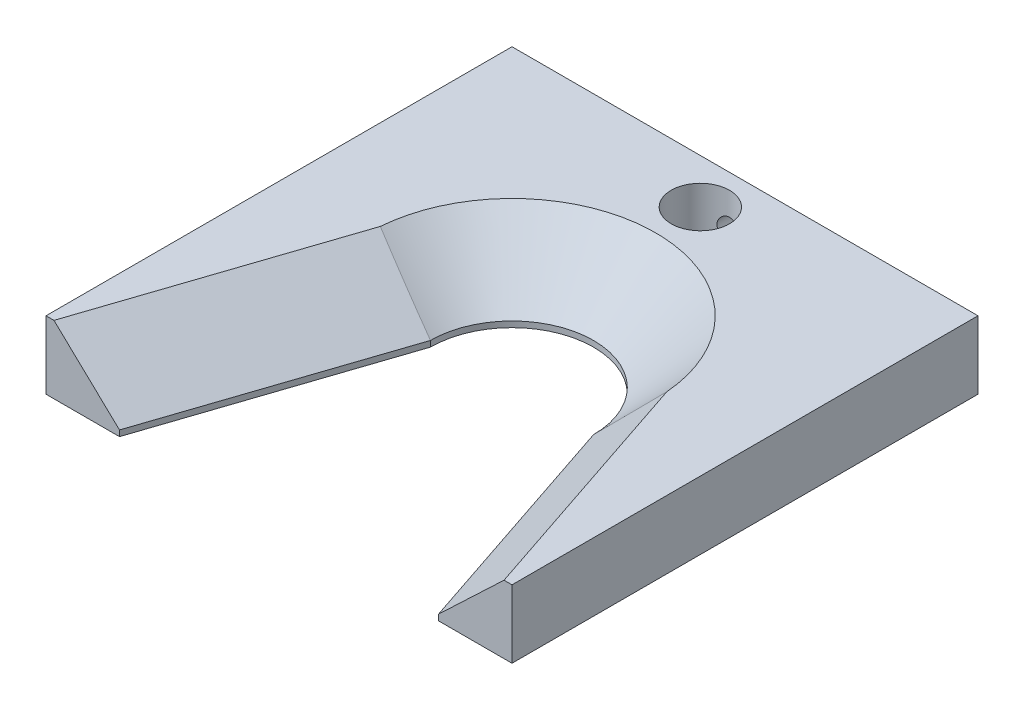
ISO-10303-21;
HEADER;
FILE_DESCRIPTION(('STEP AP214'),'2;1');
FILE_NAME('part.step','',(''),(''),'','','');
FILE_SCHEMA(('AUTOMOTIVE_DESIGN { 1 0 10303 214 1 1 1 1 }'));
ENDSEC;
DATA;
#1=APPLICATION_CONTEXT('core data for automotive mechanical design processes');
#2=APPLICATION_PROTOCOL_DEFINITION('international standard','automotive_design',2000,#1);
#3=PRODUCT_CONTEXT('',#1,'mechanical');
#4=PRODUCT('Part','Part','',(#3));
#5=PRODUCT_RELATED_PRODUCT_CATEGORY('part','',(#4));
#6=PRODUCT_DEFINITION_FORMATION('','',#4);
#7=PRODUCT_DEFINITION_CONTEXT('part definition',#1,'design');
#8=PRODUCT_DEFINITION('design','',#6,#7);
#9=PRODUCT_DEFINITION_SHAPE('','',#8);
#10=(LENGTH_UNIT() NAMED_UNIT(*) SI_UNIT(.MILLI.,.METRE.));
#11=(NAMED_UNIT(*) PLANE_ANGLE_UNIT() SI_UNIT($,.RADIAN.));
#12=(NAMED_UNIT(*) SI_UNIT($,.STERADIAN.) SOLID_ANGLE_UNIT());
#13=UNCERTAINTY_MEASURE_WITH_UNIT(LENGTH_MEASURE(1.E-05),#10,'distance_accuracy_value','');
#14=(GEOMETRIC_REPRESENTATION_CONTEXT(3) GLOBAL_UNCERTAINTY_ASSIGNED_CONTEXT((#13)) GLOBAL_UNIT_ASSIGNED_CONTEXT((#10,
#11,#12)) REPRESENTATION_CONTEXT('',''));
#15=CARTESIAN_POINT('',(0.,0.,0.));
#16=DIRECTION('',(0.,0.,1.));
#17=DIRECTION('',(1.,0.,0.));
#18=AXIS2_PLACEMENT_3D('',#15,#16,#17);
#19=CARTESIAN_POINT('',(0.,11.1125,0.));
#20=DIRECTION('',(0.,-1.,0.));
#21=DIRECTION('',(0.,0.,-1.));
#22=AXIS2_PLACEMENT_3D('',#19,#20,#21);
#23=CYLINDRICAL_SURFACE('',#22,13.335);
#24=DIRECTION('',(0.,-1.,0.));
#25=VECTOR('',#24,1.);
#26=CARTESIAN_POINT('',(13.335,11.1125,0.));
#27=LINE('',#26,#25);
#28=CARTESIAN_POINT('',(13.335,0.952500000000011,0.));
#29=VERTEX_POINT('',#28);
#30=CARTESIAN_POINT('',(13.335,0.,0.));
#31=VERTEX_POINT('',#30);
#32=EDGE_CURVE('E220',#29,#31,#27,.T.);
#33=ORIENTED_EDGE('',*,*,#32,.F.);
#34=CARTESIAN_POINT('',(0.,0.952500000000011,0.));
#35=DIRECTION('',(0.,1.,0.));
#36=DIRECTION('',(0.,0.,1.));
#37=AXIS2_PLACEMENT_3D('',#34,#35,#36);
#38=CIRCLE('',#37,13.335);
#39=CARTESIAN_POINT('',(-13.335,0.952500000000012,0.));
#40=VERTEX_POINT('',#39);
#41=EDGE_CURVE('E76',#29,#40,#38,.T.);
#42=ORIENTED_EDGE('',*,*,#41,.T.);
#43=DIRECTION('',(0.,-1.,0.));
#44=VECTOR('',#43,1.);
#45=CARTESIAN_POINT('',(-13.335,11.1125,0.));
#46=LINE('',#45,#44);
#47=CARTESIAN_POINT('',(-13.335,0.,0.));
#48=VERTEX_POINT('',#47);
#49=EDGE_CURVE('E198',#40,#48,#46,.T.);
#50=ORIENTED_EDGE('',*,*,#49,.T.);
#51=CARTESIAN_POINT('',(0.,0.,0.));
#52=DIRECTION('',(0.,1.,0.));
#53=DIRECTION('',(0.,0.,1.));
#54=AXIS2_PLACEMENT_3D('',#51,#52,#53);
#55=CIRCLE('',#54,13.335);
#56=EDGE_CURVE('E171',#31,#48,#55,.T.);
#57=ORIENTED_EDGE('',*,*,#56,.F.);
#58=EDGE_LOOP('',(#33,#42,#50,#57));
#59=FACE_BOUND('',#58,.T.);
#60=ADVANCED_FACE('F44',(#59),#23,.F.);
#61=CARTESIAN_POINT('',(11.9924022632403,11.1125,-4.01260166686629));
#62=DIRECTION('',(0.948323655206199,0.,-0.317304656405093));
#63=DIRECTION('',(-0.317304656405093,0.,-0.948323655206199));
#64=AXIS2_PLACEMENT_3D('',#61,#62,#63);
#65=PLANE('',#64);
#66=DIRECTION('',(0.,-1.,0.));
#67=VECTOR('',#66,1.);
#68=CARTESIAN_POINT('',(26.083081673029,11.1125,38.1));
#69=LINE('',#68,#67);
#70=CARTESIAN_POINT('',(26.083081673029,0.952500000000009,38.1));
#71=VERTEX_POINT('',#70);
#72=CARTESIAN_POINT('',(26.083081673029,0.,38.1));
#73=VERTEX_POINT('',#72);
#74=EDGE_CURVE('E217',#71,#73,#69,.T.);
#75=ORIENTED_EDGE('',*,*,#74,.F.);
#76=DIRECTION('',(-0.317304656405093,0.,-0.948323655206199));
#77=VECTOR('',#76,1.);
#78=CARTESIAN_POINT('',(13.335,0.952500000000008,0.));
#79=LINE('',#78,#77);
#80=EDGE_CURVE('E236',#71,#29,#79,.T.);
#81=ORIENTED_EDGE('',*,*,#80,.T.);
#82=ORIENTED_EDGE('',*,*,#32,.T.);
#83=DIRECTION('',(0.317304656405093,0.,0.948323655206199));
#84=VECTOR('',#83,1.);
#85=CARTESIAN_POINT('',(11.9924022632403,0.,-4.01260166686629));
#86=LINE('',#85,#84);
#87=EDGE_CURVE('E175',#31,#73,#86,.T.);
#88=ORIENTED_EDGE('',*,*,#87,.T.);
#89=EDGE_LOOP('',(#75,#81,#82,#88));
#90=FACE_BOUND('',#89,.T.);
#91=ADVANCED_FACE('F271',(#90),#65,.F.);
#92=CARTESIAN_POINT('',(0.,11.1125,38.1));
#93=DIRECTION('',(0.,0.,1.));
#94=DIRECTION('',(1.,0.,0.));
#95=AXIS2_PLACEMENT_3D('',#92,#93,#94);
#96=PLANE('',#95);
#97=DIRECTION('',(-1.,0.,0.));
#98=VECTOR('',#97,1.);
#99=CARTESIAN_POINT('',(0.,11.1125,38.1));
#100=LINE('',#99,#98);
#101=CARTESIAN_POINT('',(38.1,11.1125,38.1));
#102=VERTEX_POINT('',#101);
#103=CARTESIAN_POINT('',(36.7967235232799,11.1125,38.1));
#104=VERTEX_POINT('',#103);
#105=EDGE_CURVE('E154',#102,#104,#100,.T.);
#106=ORIENTED_EDGE('',*,*,#105,.T.);
#107=DIRECTION('',(-0.725606535862985,-0.688109842331091,0.));
#108=VECTOR('',#107,1.);
#109=CARTESIAN_POINT('',(17.4230703123026,-7.25999362773124,38.1));
#110=LINE('',#109,#108);
#111=EDGE_CURVE('E233',#104,#71,#110,.T.);
#112=ORIENTED_EDGE('',*,*,#111,.T.);
#113=ORIENTED_EDGE('',*,*,#74,.T.);
#114=DIRECTION('',(-1.,0.,0.));
#115=VECTOR('',#114,1.);
#116=CARTESIAN_POINT('',(0.,0.,38.1));
#117=LINE('',#116,#115);
#118=CARTESIAN_POINT('',(38.1,0.,38.1));
#119=VERTEX_POINT('',#118);
#120=EDGE_CURVE('E179',#119,#73,#117,.T.);
#121=ORIENTED_EDGE('',*,*,#120,.F.);
#122=DIRECTION('',(0.,-1.,0.));
#123=VECTOR('',#122,1.);
#124=CARTESIAN_POINT('',(38.1,11.1125,38.1));
#125=LINE('',#124,#123);
#126=EDGE_CURVE('E214',#102,#119,#125,.T.);
#127=ORIENTED_EDGE('',*,*,#126,.F.);
#128=EDGE_LOOP('',(#106,#112,#113,#121,#127));
#129=FACE_BOUND('',#128,.T.);
#130=ADVANCED_FACE('F275',(#129),#96,.T.);
#131=CARTESIAN_POINT('',(38.1,11.1125,0.));
#132=DIRECTION('',(1.,0.,0.));
#133=DIRECTION('',(0.,0.,-1.));
#134=AXIS2_PLACEMENT_3D('',#131,#132,#133);
#135=PLANE('',#134);
#136=DIRECTION('',(0.,0.,1.));
#137=VECTOR('',#136,1.);
#138=CARTESIAN_POINT('',(38.1,0.,0.));
#139=LINE('',#138,#137);
#140=CARTESIAN_POINT('',(38.1,0.,-38.1));
#141=VERTEX_POINT('',#140);
#142=EDGE_CURVE('E183',#141,#119,#139,.T.);
#143=ORIENTED_EDGE('',*,*,#142,.F.);
#144=DIRECTION('',(0.,-1.,0.));
#145=VECTOR('',#144,1.);
#146=CARTESIAN_POINT('',(38.1,11.1125,-38.1));
#147=LINE('',#146,#145);
#148=CARTESIAN_POINT('',(38.1,11.1125,-38.1));
#149=VERTEX_POINT('',#148);
#150=EDGE_CURVE('E211',#149,#141,#147,.T.);
#151=ORIENTED_EDGE('',*,*,#150,.F.);
#152=DIRECTION('',(0.,0.,1.));
#153=VECTOR('',#152,1.);
#154=CARTESIAN_POINT('',(38.1,11.1125,0.));
#155=LINE('',#154,#153);
#156=EDGE_CURVE('E158',#149,#102,#155,.T.);
#157=ORIENTED_EDGE('',*,*,#156,.T.);
#158=ORIENTED_EDGE('',*,*,#126,.T.);
#159=EDGE_LOOP('',(#143,#151,#157,#158));
#160=FACE_BOUND('',#159,.T.);
#161=ADVANCED_FACE('F279',(#160),#135,.T.);
#162=CARTESIAN_POINT('',(0.,11.1125,-38.1));
#163=DIRECTION('',(0.,0.,1.));
#164=DIRECTION('',(1.,0.,0.));
#165=AXIS2_PLACEMENT_3D('',#162,#163,#164);
#166=PLANE('',#165);
#167=CARTESIAN_POINT('',(0.,5.55625,-38.1));
#168=DIRECTION('',(0.,0.,-1.));
#169=DIRECTION('',(-1.,0.,0.));
#170=AXIS2_PLACEMENT_3D('',#167,#168,#169);
#171=CIRCLE('',#170,1.7272);
#172=CARTESIAN_POINT('',(-1.72719999999999,5.55625,-38.1));
#173=VERTEX_POINT('',#172);
#174=EDGE_CURVE('E143',#173,#173,#171,.T.);
#175=ORIENTED_EDGE('',*,*,#174,.F.);
#176=EDGE_LOOP('',(#175));
#177=FACE_BOUND('',#176,.T.);
#178=DIRECTION('',(-1.,0.,0.));
#179=VECTOR('',#178,1.);
#180=CARTESIAN_POINT('',(0.,0.,-38.1));
#181=LINE('',#180,#179);
#182=CARTESIAN_POINT('',(-38.1,0.,-38.1));
#183=VERTEX_POINT('',#182);
#184=EDGE_CURVE('E188',#141,#183,#181,.T.);
#185=ORIENTED_EDGE('',*,*,#184,.T.);
#186=DIRECTION('',(0.,-1.,0.));
#187=VECTOR('',#186,1.);
#188=CARTESIAN_POINT('',(-38.1,11.1125,-38.1));
#189=LINE('',#188,#187);
#190=CARTESIAN_POINT('',(-38.1,11.1125,-38.1));
#191=VERTEX_POINT('',#190);
#192=EDGE_CURVE('E207',#191,#183,#189,.T.);
#193=ORIENTED_EDGE('',*,*,#192,.F.);
#194=DIRECTION('',(-1.,0.,0.));
#195=VECTOR('',#194,1.);
#196=CARTESIAN_POINT('',(0.,11.1125,-38.1));
#197=LINE('',#196,#195);
#198=EDGE_CURVE('E164',#149,#191,#197,.T.);
#199=ORIENTED_EDGE('',*,*,#198,.F.);
#200=ORIENTED_EDGE('',*,*,#150,.T.);
#201=EDGE_LOOP('',(#185,#193,#199,#200));
#202=FACE_BOUND('',#201,.T.);
#203=ADVANCED_FACE('F282',(#177,#202),#166,.F.);
#204=CARTESIAN_POINT('',(-38.1,11.1125,0.));
#205=DIRECTION('',(1.,0.,0.));
#206=DIRECTION('',(0.,0.,-1.));
#207=AXIS2_PLACEMENT_3D('',#204,#205,#206);
#208=PLANE('',#207);
#209=DIRECTION('',(0.,0.,1.));
#210=VECTOR('',#209,1.);
#211=CARTESIAN_POINT('',(-38.1,0.,0.));
#212=LINE('',#211,#210);
#213=CARTESIAN_POINT('',(-38.1,0.,38.1));
#214=VERTEX_POINT('',#213);
#215=EDGE_CURVE('E191',#183,#214,#212,.T.);
#216=ORIENTED_EDGE('',*,*,#215,.T.);
#217=DIRECTION('',(0.,-1.,0.));
#218=VECTOR('',#217,1.);
#219=CARTESIAN_POINT('',(-38.1,11.1125,38.1));
#220=LINE('',#219,#218);
#221=CARTESIAN_POINT('',(-38.1,11.1125,38.1));
#222=VERTEX_POINT('',#221);
#223=EDGE_CURVE('E204',#222,#214,#220,.T.);
#224=ORIENTED_EDGE('',*,*,#223,.F.);
#225=DIRECTION('',(0.,0.,1.));
#226=VECTOR('',#225,1.);
#227=CARTESIAN_POINT('',(-38.1,11.1125,0.));
#228=LINE('',#227,#226);
#229=EDGE_CURVE('E167',#191,#222,#228,.T.);
#230=ORIENTED_EDGE('',*,*,#229,.F.);
#231=ORIENTED_EDGE('',*,*,#192,.T.);
#232=EDGE_LOOP('',(#216,#224,#230,#231));
#233=FACE_BOUND('',#232,.T.);
#234=ADVANCED_FACE('F286',(#233),#208,.F.);
#235=DIRECTION('',(0.,-1.,0.));
#236=VECTOR('',#235,1.);
#237=CARTESIAN_POINT('',(-26.083081673029,11.1125,38.1));
#238=LINE('',#237,#236);
#239=CARTESIAN_POINT('',(-26.083081673029,0.952500000000012,38.1));
#240=VERTEX_POINT('',#239);
#241=CARTESIAN_POINT('',(-26.083081673029,0.,38.1));
#242=VERTEX_POINT('',#241);
#243=EDGE_CURVE('E201',#240,#242,#238,.T.);
#244=ORIENTED_EDGE('',*,*,#243,.F.);
#245=DIRECTION('',(0.725606535862985,-0.688109842331091,0.));
#246=VECTOR('',#245,1.);
#247=CARTESIAN_POINT('',(-17.4230703123026,-7.25999362773123,38.1));
#248=LINE('',#247,#246);
#249=CARTESIAN_POINT('',(-36.7967235232799,11.1125,38.1));
#250=VERTEX_POINT('',#249);
#251=EDGE_CURVE('E11',#240,#250,#248,.F.);
#252=ORIENTED_EDGE('',*,*,#251,.T.);
#253=EDGE_CURVE('E160',#250,#222,#100,.T.);
#254=ORIENTED_EDGE('',*,*,#253,.T.);
#255=ORIENTED_EDGE('',*,*,#223,.T.);
#256=EDGE_CURVE('E184',#242,#214,#117,.T.);
#257=ORIENTED_EDGE('',*,*,#256,.F.);
#258=EDGE_LOOP('',(#244,#252,#254,#255,#257));
#259=FACE_BOUND('',#258,.T.);
#260=ADVANCED_FACE('F290',(#259),#96,.T.);
#261=CARTESIAN_POINT('',(-11.9924022632403,11.1125,-4.01260166686629));
#262=DIRECTION('',(0.948323655206199,0.,0.317304656405093));
#263=DIRECTION('',(0.317304656405093,0.,-0.948323655206199));
#264=AXIS2_PLACEMENT_3D('',#261,#262,#263);
#265=PLANE('',#264);
#266=ORIENTED_EDGE('',*,*,#49,.F.);
#267=DIRECTION('',(-0.317304656405093,0.,0.948323655206199));
#268=VECTOR('',#267,1.);
#269=CARTESIAN_POINT('',(-11.9924022632403,0.952500000000012,-4.01260166686629));
#270=LINE('',#269,#268);
#271=EDGE_CURVE('E61',#40,#240,#270,.T.);
#272=ORIENTED_EDGE('',*,*,#271,.T.);
#273=ORIENTED_EDGE('',*,*,#243,.T.);
#274=DIRECTION('',(-0.317304656405093,0.,0.948323655206199));
#275=VECTOR('',#274,1.);
#276=CARTESIAN_POINT('',(-11.9924022632403,0.,-4.01260166686629));
#277=LINE('',#276,#275);
#278=EDGE_CURVE('E159',#48,#242,#277,.T.);
#279=ORIENTED_EDGE('',*,*,#278,.F.);
#280=EDGE_LOOP('',(#266,#272,#273,#279));
#281=FACE_BOUND('',#280,.T.);
#282=ADVANCED_FACE('F294',(#281),#265,.T.);
#283=CARTESIAN_POINT('',(0.,11.1125,0.));
#284=DIRECTION('',(0.,1.,0.));
#285=DIRECTION('',(0.,0.,1.));
#286=AXIS2_PLACEMENT_3D('',#283,#284,#285);
#287=PLANE('',#286);
#288=CARTESIAN_POINT('',(0.,11.1125,-30.7975));
#289=DIRECTION('',(0.,1.,0.));
#290=DIRECTION('',(0.,0.,1.));
#291=AXIS2_PLACEMENT_3D('',#288,#289,#290);
#292=CIRCLE('',#291,4.7625);
#293=CARTESIAN_POINT('',(0.,11.1125,-26.035));
#294=VERTEX_POINT('',#293);
#295=EDGE_CURVE('E320',#294,#294,#292,.T.);
#296=ORIENTED_EDGE('',*,*,#295,.F.);
#297=EDGE_LOOP('',(#296));
#298=FACE_BOUND('',#297,.T.);
#299=CARTESIAN_POINT('',(0.,11.1125,0.));
#300=DIRECTION('',(0.,1.,0.));
#301=DIRECTION('',(0.,0.,1.));
#302=AXIS2_PLACEMENT_3D('',#299,#300,#301);
#303=CIRCLE('',#302,23.495);
#304=CARTESIAN_POINT('',(-23.4196823274798,11.1125,-1.87976186787994));
#305=VERTEX_POINT('',#304);
#306=CARTESIAN_POINT('',(23.4196823274797,11.1125,-1.87976186788));
#307=VERTEX_POINT('',#306);
#308=EDGE_CURVE('E226',#305,#307,#303,.F.);
#309=ORIENTED_EDGE('',*,*,#308,.T.);
#310=DIRECTION('',(0.317304656405093,0.,0.948323655206199));
#311=VECTOR('',#310,1.);
#312=CARTESIAN_POINT('',(35.718050009924,11.1125,34.8761846909243));
#313=LINE('',#312,#311);
#314=EDGE_CURVE('E229',#307,#104,#313,.T.);
#315=ORIENTED_EDGE('',*,*,#314,.T.);
#316=ORIENTED_EDGE('',*,*,#105,.F.);
#317=ORIENTED_EDGE('',*,*,#156,.F.);
#318=ORIENTED_EDGE('',*,*,#198,.T.);
#319=ORIENTED_EDGE('',*,*,#229,.T.);
#320=ORIENTED_EDGE('',*,*,#253,.F.);
#321=DIRECTION('',(0.317304656405093,0.,-0.948323655206199));
#322=VECTOR('',#321,1.);
#323=CARTESIAN_POINT('',(-21.6273706001353,11.1125,-7.23641697594204));
#324=LINE('',#323,#322);
#325=EDGE_CURVE('E223',#250,#305,#324,.T.);
#326=ORIENTED_EDGE('',*,*,#325,.T.);
#327=EDGE_LOOP('',(#309,#315,#316,#317,#318,#319,#320,#326));
#328=FACE_BOUND('',#327,.T.);
#329=ADVANCED_FACE('F298',(#298,#328),#287,.T.);
#330=CARTESIAN_POINT('',(0.,0.,0.));
#331=DIRECTION('',(0.,1.,0.));
#332=DIRECTION('',(0.,0.,1.));
#333=AXIS2_PLACEMENT_3D('',#330,#331,#332);
#334=PLANE('',#333);
#335=CARTESIAN_POINT('',(0.,0.,-30.7975));
#336=DIRECTION('',(0.,1.,0.));
#337=DIRECTION('',(0.,0.,1.));
#338=AXIS2_PLACEMENT_3D('',#335,#336,#337);
#339=CIRCLE('',#338,4.7625);
#340=CARTESIAN_POINT('',(0.,0.,-26.035));
#341=VERTEX_POINT('',#340);
#342=EDGE_CURVE('E314',#341,#341,#339,.T.);
#343=ORIENTED_EDGE('',*,*,#342,.T.);
#344=EDGE_LOOP('',(#343));
#345=FACE_BOUND('',#344,.T.);
#346=ORIENTED_EDGE('',*,*,#56,.T.);
#347=ORIENTED_EDGE('',*,*,#278,.T.);
#348=ORIENTED_EDGE('',*,*,#256,.T.);
#349=ORIENTED_EDGE('',*,*,#215,.F.);
#350=ORIENTED_EDGE('',*,*,#184,.F.);
#351=ORIENTED_EDGE('',*,*,#142,.T.);
#352=ORIENTED_EDGE('',*,*,#120,.T.);
#353=ORIENTED_EDGE('',*,*,#87,.F.);
#354=EDGE_LOOP('',(#346,#347,#348,#349,#350,#351,#352,#353));
#355=FACE_BOUND('',#354,.T.);
#356=ADVANCED_FACE('F299',(#345,#355),#334,.F.);
#357=CARTESIAN_POINT('',(-11.9924022632403,0.952500000000011,-4.01260166686629));
#358=DIRECTION('',(-0.670566087355916,-0.707106781186549,-0.224368274246108));
#359=DIRECTION('',(-0.317304656405093,0.,0.948323655206199));
#360=AXIS2_PLACEMENT_3D('',#357,#358,#359);
#361=PLANE('',#360);
#362=ORIENTED_EDGE('',*,*,#251,.F.);
#363=ORIENTED_EDGE('',*,*,#271,.F.);
#364=CARTESIAN_POINT('',(-13.335,0.952500000000012,0.));
#365=CARTESIAN_POINT('',(-14.1802182107889,1.79777629778931,-0.137835590509843));
#366=CARTESIAN_POINT('',(-15.0239193030969,2.64354546694068,-0.28175867663717));
#367=CARTESIAN_POINT('',(-16.708748163143,4.33580986815329,-0.579583925492418));
#368=CARTESIAN_POINT('',(-17.5498760556182,5.1823050623891,-0.733485596212048));
#369=CARTESIAN_POINT('',(-19.2300756855446,6.87581802542853,-1.04908105467809));
#370=CARTESIAN_POINT('',(-20.0691474880417,7.72283577661118,-1.21077459248934));
#371=CARTESIAN_POINT('',(-21.7456096435228,9.41734861276061,-1.54069133003352));
#372=CARTESIAN_POINT('',(-22.5829999124839,10.2648437189974,-1.70891484791784));
#373=CARTESIAN_POINT('',(-23.4196823274798,11.1125,-1.87976186787987));
#374=B_SPLINE_CURVE_WITH_KNOTS('',3,(#364,#365,#366,#367,#368,#369,#370,#371,#372,#373),
.UNSPECIFIED.,.F.,.F.,(4,2,2,2,4),(0.,3.60979400428527,7.21941015770133,10.8289106045433,
14.4385871334727),.UNSPECIFIED.);
#375=EDGE_CURVE('E148',#305,#40,#374,.F.);
#376=ORIENTED_EDGE('',*,*,#375,.F.);
#377=ORIENTED_EDGE('',*,*,#325,.F.);
#378=EDGE_LOOP('',(#362,#363,#376,#377));
#379=FACE_BOUND('',#378,.T.);
#380=ADVANCED_FACE('F47',(#379),#361,.F.);
#381=CARTESIAN_POINT('',(0.,0.952500000000011,0.));
#382=DIRECTION('',(0.,1.,0.));
#383=DIRECTION('',(0.,0.,1.));
#384=AXIS2_PLACEMENT_3D('',#381,#382,#383);
#385=CONICAL_SURFACE('',#384,13.335,0.78539816339745);
#386=ORIENTED_EDGE('',*,*,#375,.T.);
#387=ORIENTED_EDGE('',*,*,#41,.F.);
#388=CARTESIAN_POINT('',(13.335,0.952500000000011,0.));
#389=CARTESIAN_POINT('',(14.1802182107889,1.79777629778931,-0.137835590509873));
#390=CARTESIAN_POINT('',(15.0239193030969,2.64354546694069,-0.281758676637214));
#391=CARTESIAN_POINT('',(16.708748163143,4.3358098681533,-0.579583925492474));
#392=CARTESIAN_POINT('',(17.5498760556182,5.18230506238911,-0.733485596212103));
#393=CARTESIAN_POINT('',(19.2300756855446,6.87581802542855,-1.04908105467815));
#394=CARTESIAN_POINT('',(20.0691474880417,7.72283577661119,-1.2107745924894));
#395=CARTESIAN_POINT('',(21.7456096435228,9.41734861276063,-1.5406913300336));
#396=CARTESIAN_POINT('',(22.5829999124839,10.2648437189975,-1.70891484791793));
#397=CARTESIAN_POINT('',(23.4196823274798,11.1125,-1.87976186787997));
#398=B_SPLINE_CURVE_WITH_KNOTS('',3,(#388,#389,#390,#391,#392,#393,#394,#395,#396,#397),
.UNSPECIFIED.,.F.,.F.,(4,2,2,2,4),(0.,3.60979400428527,7.21941015770135,10.8289106045433,
14.4385871334728),.UNSPECIFIED.);
#399=EDGE_CURVE('E142',#307,#29,#398,.F.);
#400=ORIENTED_EDGE('',*,*,#399,.F.);
#401=ORIENTED_EDGE('',*,*,#308,.F.);
#402=EDGE_LOOP('',(#386,#387,#400,#401));
#403=FACE_BOUND('',#402,.T.);
#404=ADVANCED_FACE('F253',(#403),#385,.F.);
#405=CARTESIAN_POINT('',(21.6273706001353,11.1125,-7.23641697594204));
#406=DIRECTION('',(-0.670566087355915,0.707106781186549,0.224368274246108));
#407=DIRECTION('',(-0.317304656405093,0.,-0.948323655206199));
#408=AXIS2_PLACEMENT_3D('',#405,#406,#407);
#409=PLANE('',#408);
#410=ORIENTED_EDGE('',*,*,#399,.T.);
#411=ORIENTED_EDGE('',*,*,#80,.F.);
#412=ORIENTED_EDGE('',*,*,#111,.F.);
#413=ORIENTED_EDGE('',*,*,#314,.F.);
#414=EDGE_LOOP('',(#410,#411,#412,#413));
#415=FACE_BOUND('',#414,.T.);
#416=ADVANCED_FACE('F257',(#415),#409,.T.);
#417=CARTESIAN_POINT('',(0.,5.55625,-38.1));
#418=DIRECTION('',(0.,0.,-1.));
#419=DIRECTION('',(-1.,0.,0.));
#420=AXIS2_PLACEMENT_3D('',#417,#418,#419);
#421=CYLINDRICAL_SURFACE('',#420,1.7272);
#422=CARTESIAN_POINT('',(-1.72719999999999,5.55625,-35.2357638959395));
#423=CARTESIAN_POINT('',(-1.72720245273679,5.46272498980388,-35.2357617007651));
#424=CARTESIAN_POINT('',(-1.71957825372233,5.36921673340335,-35.2387522708721));
#425=CARTESIAN_POINT('',(-1.68941050563446,5.18500466358786,-35.2503143264945));
#426=CARTESIAN_POINT('',(-1.66686659813382,5.09430091760253,-35.2588859460875));
#427=CARTESIAN_POINT('',(-1.60778321664955,4.91840457026749,-35.2805141815691));
#428=CARTESIAN_POINT('',(-1.57127535149555,4.83320002633721,-35.2935606613216));
#429=CARTESIAN_POINT('',(-1.48541126703647,4.67009325013085,-35.3226527778179));
#430=CARTESIAN_POINT('',(-1.43605147089428,4.59219305896057,-35.338699249142));
#431=CARTESIAN_POINT('',(-1.32342999758052,4.44228953304191,-35.3728183027607));
#432=CARTESIAN_POINT('',(-1.25966957164587,4.3706737622447,-35.3909478101386));
#433=CARTESIAN_POINT('',(-1.12111687463676,4.23888092113113,-35.4267134595369));
#434=CARTESIAN_POINT('',(-1.04632244588852,4.17870609334432,-35.4443495042575));
#435=CARTESIAN_POINT('',(-0.884916230268795,4.06967006832086,-35.4778123377053));
#436=CARTESIAN_POINT('',(-0.79800616841293,4.02122547569919,-35.4935645355822));
#437=CARTESIAN_POINT('',(-0.616598609894425,3.93980301297188,-35.520804781633));
#438=CARTESIAN_POINT('',(-0.522103573589328,3.90682015106068,-35.5322942057893));
#439=CARTESIAN_POINT('',(-0.332279703113261,3.85860275783029,-35.5493105560669));
#440=CARTESIAN_POINT('',(-0.237140482332057,3.842702013056,-35.555060620522));
#441=CARTESIAN_POINT('',(-0.0453819346065112,3.82697059541879,-35.5607484885006));
#442=CARTESIAN_POINT('',(0.0512369330673605,3.82713503323271,-35.5606880604061));
#443=CARTESIAN_POINT('',(0.238455394782952,3.843130665219,-35.5549065600523));
#444=CARTESIAN_POINT('',(0.329126502548628,3.85823582695718,-35.5494478168455));
#445=CARTESIAN_POINT('',(0.506546797648024,3.90246920680586,-35.5338225806931));
#446=CARTESIAN_POINT('',(0.593295709282359,3.93159840902435,-35.5236557573696));
#447=CARTESIAN_POINT('',(0.761867255258722,4.00341603644507,-35.4994490350849));
#448=CARTESIAN_POINT('',(0.843602448051961,4.04629112273122,-35.485356190253));
#449=CARTESIAN_POINT('',(0.998915520069446,4.14422207017831,-35.4547362407252));
#450=CARTESIAN_POINT('',(1.0724908560108,4.19928171312239,-35.4382083807947));
#451=CARTESIAN_POINT('',(1.21368780451131,4.32356739807278,-35.4033600477915));
#452=CARTESIAN_POINT('',(1.28075862488538,4.39340648202074,-35.3849909792205));
#453=CARTESIAN_POINT('',(1.40243506145783,4.54346694100143,-35.3492702954252));
#454=CARTESIAN_POINT('',(1.45703795078785,4.62369058124635,-35.3319189033929));
#455=CARTESIAN_POINT('',(1.55318831431885,4.79428276059363,-35.2999037783679));
#456=CARTESIAN_POINT('',(1.59445924480796,4.88481917415453,-35.285299318579));
#457=CARTESIAN_POINT('',(1.66096705219199,5.07222464045876,-35.2611153522292));
#458=CARTESIAN_POINT('',(1.68621216073414,5.16909041388538,-35.2515332663728));
#459=CARTESIAN_POINT('',(1.71873956307094,5.36099205010188,-35.2390796635243));
#460=CARTESIAN_POINT('',(1.72689070574209,5.455859501934,-35.2358839723758));
#461=CARTESIAN_POINT('',(1.72749177863266,5.64563987243235,-35.2356506358191));
#462=CARTESIAN_POINT('',(1.71994527875207,5.7405527758545,-35.2386115902892));
#463=CARTESIAN_POINT('',(1.69015114043404,5.92343420914205,-35.2500304605055));
#464=CARTESIAN_POINT('',(1.66855346979375,6.01152554039076,-35.2582450837763));
#465=CARTESIAN_POINT('',(1.61207609237182,6.18280117283182,-35.2789635183171));
#466=CARTESIAN_POINT('',(1.57719377247721,6.26598450489221,-35.2914681733957));
#467=CARTESIAN_POINT('',(1.4937258238269,6.42839496168185,-35.3199102395786));
#468=CARTESIAN_POINT('',(1.44469384268603,6.50737341785869,-35.3359546256793));
#469=CARTESIAN_POINT('',(1.33480249857168,6.65629197107228,-35.3694803302133));
#470=CARTESIAN_POINT('',(1.27393905489091,6.7262289357742,-35.3869621432155));
#471=CARTESIAN_POINT('',(1.13788812985202,6.85932543297262,-35.4226311509528));
#472=CARTESIAN_POINT('',(1.06207032390726,6.92184777502578,-35.4407996606783));
#473=CARTESIAN_POINT('',(0.900571093459925,7.03334778147633,-35.4748045937269));
#474=CARTESIAN_POINT('',(0.814889778632481,7.08232559645853,-35.4906410429763));
#475=CARTESIAN_POINT('',(0.636285986394663,7.16497400027347,-35.5181634040279));
#476=CARTESIAN_POINT('',(0.543399153377704,7.19871493099547,-35.5298683333283));
#477=CARTESIAN_POINT('',(0.352750974361678,7.24991970615501,-35.5478812661365));
#478=CARTESIAN_POINT('',(0.254991772646449,7.26739064537755,-35.554191621934));
#479=CARTESIAN_POINT('',(0.0631529693710983,7.2848320709106,-35.5604952109294));
#480=CARTESIAN_POINT('',(-0.0308341067488581,7.2857104276609,-35.5608161455879));
#481=CARTESIAN_POINT('',(-0.217556559086095,7.27224766054948,-35.5559445675288));
#482=CARTESIAN_POINT('',(-0.310292069068735,7.25790817640223,-35.5507526488183));
#483=CARTESIAN_POINT('',(-0.489853436423977,7.21504571766986,-35.5355800067323));
#484=CARTESIAN_POINT('',(-0.57676371301768,7.18683608787764,-35.5257052424854));
#485=CARTESIAN_POINT('',(-0.744633743801227,7.11733872682683,-35.5021911189112));
#486=CARTESIAN_POINT('',(-0.82559237434577,7.07604853378646,-35.4885510510102));
#487=CARTESIAN_POINT('',(-0.982864628077254,6.97964296893058,-35.4581931083884));
#488=CARTESIAN_POINT('',(-1.05885511954382,6.92403333450336,-35.4413725663366));
#489=CARTESIAN_POINT('',(-1.20071184893347,6.80136476510012,-35.4067340536962));
#490=CARTESIAN_POINT('',(-1.26657456141552,6.73430186035272,-35.3889157387176));
#491=CARTESIAN_POINT('',(-1.38958521655537,6.58675308174843,-35.3532395566432));
#492=CARTESIAN_POINT('',(-1.44615494259524,6.50577365663368,-35.3354217542728));
#493=CARTESIAN_POINT('',(-1.5448849649361,6.33489289542014,-35.3027693457302));
#494=CARTESIAN_POINT('',(-1.58704550749888,6.24499171183358,-35.2879346885758));
#495=CARTESIAN_POINT('',(-1.65604477445503,6.05714988212569,-35.2629567363915));
#496=CARTESIAN_POINT('',(-1.68262483133596,5.95910277808411,-35.2528931454104));
#497=CARTESIAN_POINT('',(-1.71819630529829,5.75944587485288,-35.2392997029428));
#498=CARTESIAN_POINT('',(-1.72719733580613,5.6578380538763,-35.2357662803659));
#499=CARTESIAN_POINT('',(-1.72719999999999,5.55625,-35.2357638959395));
#500=B_SPLINE_CURVE_WITH_KNOTS('',3,(#422,#423,#424,#425,#426,#427,#428,#429,#430,#431,#432,
#433,#434,#435,#436,#437,#438,#439,#440,#441,#442,#443,#444,#445,#446,#447,#448,#449,#450,#451,
#452,#453,#454,#455,#456,#457,#458,#459,#460,#461,#462,#463,#464,#465,#466,#467,#468,#469,#470,
#471,#472,#473,#474,#475,#476,#477,#478,#479,#480,#481,#482,#483,#484,#485,#486,#487,#488,#489,
#490,#491,#492,#493,#494,#495,#496,#497,#498,#499),.UNSPECIFIED.,.T.,.F.,(4,2,2,2,2,2,2,2,2,2,2,
2,2,2,2,2,2,2,2,2,2,2,2,2,2,2,2,2,2,2,2,2,2,2,2,2,2,2,4),(0.,0.280197377116419,
0.560401485866796,0.839975042418159,1.11962649076282,1.41107897984469,1.7025885375201,
2.00329061840767,2.30389555093068,2.59229594586659,2.88060856848309,3.15556663367877,
3.43054399630027,3.70942590205295,3.98839448751232,4.28272167255984,4.57711316854827,
4.87726856373806,5.17726965939737,5.46161111225916,5.74588790830588,6.01786922644992,
6.28990407143388,6.5716894303409,6.85357215086379,7.15197079247293,7.45036611642391,
7.7473694353212,8.04424318053446,8.32482325988272,8.60537310994208,8.87985756501396,
9.15439370919544,9.44010280878059,9.72591113856107,10.0255929919408,10.3252697233174,
10.6297902525018,10.9341442021331),.UNSPECIFIED.);
#501=CARTESIAN_POINT('',(-1.72719999999999,5.55625,-35.2357638959395));
#502=VERTEX_POINT('',#501);
#503=EDGE_CURVE('E308',#502,#502,#500,.T.);
#504=ORIENTED_EDGE('',*,*,#503,.T.);
#505=EDGE_LOOP('',(#504));
#506=FACE_BOUND('',#505,.T.);
#507=ORIENTED_EDGE('',*,*,#174,.T.);
#508=EDGE_LOOP('',(#507));
#509=FACE_BOUND('',#508,.T.);
#510=ADVANCED_FACE('F262',(#506,#509),#421,.F.);
#511=CARTESIAN_POINT('',(0.,0.,-30.7975));
#512=DIRECTION('',(0.,1.,0.));
#513=DIRECTION('',(0.,0.,1.));
#514=AXIS2_PLACEMENT_3D('',#511,#512,#513);
#515=CYLINDRICAL_SURFACE('',#514,4.7625);
#516=ORIENTED_EDGE('',*,*,#503,.F.);
#517=EDGE_LOOP('',(#516));
#518=FACE_BOUND('',#517,.T.);
#519=ORIENTED_EDGE('',*,*,#342,.F.);
#520=EDGE_LOOP('',(#519));
#521=FACE_BOUND('',#520,.T.);
#522=ORIENTED_EDGE('',*,*,#295,.T.);
#523=EDGE_LOOP('',(#522));
#524=FACE_BOUND('',#523,.T.);
#525=CARTESIAN_POINT('',(-1.72719999999999,5.55625,-26.3592361040605));
#526=CARTESIAN_POINT('',(-1.72720245273679,5.64977501019612,-26.359238299235));
#527=CARTESIAN_POINT('',(-1.71957825372233,5.74328326659665,-26.356247729128));
#528=CARTESIAN_POINT('',(-1.68941050563446,5.92749533641213,-26.3446856735056));
#529=CARTESIAN_POINT('',(-1.66686659813382,6.01819908239746,-26.3361140539126));
#530=CARTESIAN_POINT('',(-1.60778321664955,6.19409542973251,-26.3144858184309));
#531=CARTESIAN_POINT('',(-1.57127535149555,6.27929997366279,-26.3014393386784));
#532=CARTESIAN_POINT('',(-1.48541126703647,6.44240674986915,-26.2723472221821));
#533=CARTESIAN_POINT('',(-1.43605147089428,6.52030694103943,-26.256300750858));
#534=CARTESIAN_POINT('',(-1.32342999758052,6.67021046695809,-26.2221816972394));
#535=CARTESIAN_POINT('',(-1.25966957164587,6.7418262377553,-26.2040521898614));
#536=CARTESIAN_POINT('',(-1.12111687463676,6.87361907886887,-26.1682865404631));
#537=CARTESIAN_POINT('',(-1.04632244588852,6.93379390665568,-26.1506504957425));
#538=CARTESIAN_POINT('',(-0.884916230268795,7.04282993167913,-26.1171876622948));
#539=CARTESIAN_POINT('',(-0.79800616841293,7.09127452430081,-26.1014354644178));
#540=CARTESIAN_POINT('',(-0.616598609894425,7.17269698702812,-26.074195218367));
#541=CARTESIAN_POINT('',(-0.522103573589329,7.20567984893932,-26.0627057942107));
#542=CARTESIAN_POINT('',(-0.332279703113262,7.25389724216971,-26.0456894439331));
#543=CARTESIAN_POINT('',(-0.237140482332058,7.269797986944,-26.0399393794781));
#544=CARTESIAN_POINT('',(-0.0453819346065121,7.28552940458121,-26.0342515114994));
#545=CARTESIAN_POINT('',(0.0512369330673598,7.28536496676729,-26.034311939594));
#546=CARTESIAN_POINT('',(0.238455394782952,7.269369334781,-26.0400934399477));
#547=CARTESIAN_POINT('',(0.329126502548627,7.25426417304281,-26.0455521831545));
#548=CARTESIAN_POINT('',(0.506546797648023,7.21003079319414,-26.0611774193069));
#549=CARTESIAN_POINT('',(0.593295709282358,7.18090159097565,-26.0713442426304));
#550=CARTESIAN_POINT('',(0.761867255258721,7.10908396355493,-26.0955509649152));
#551=CARTESIAN_POINT('',(0.84360244805196,7.06620887726878,-26.109643809747));
#552=CARTESIAN_POINT('',(0.998915520069445,6.96827792982169,-26.1402637592748));
#553=CARTESIAN_POINT('',(1.0724908560108,6.91321828687761,-26.1567916192053));
#554=CARTESIAN_POINT('',(1.21368780451131,6.78893260192721,-26.1916399522085));
#555=CARTESIAN_POINT('',(1.28075862488538,6.71909351797926,-26.2100090207795));
#556=CARTESIAN_POINT('',(1.40243506145783,6.56903305899857,-26.2457297045748));
#557=CARTESIAN_POINT('',(1.45703795078785,6.48880941875364,-26.2630810966071));
#558=CARTESIAN_POINT('',(1.55318831431885,6.31821723940637,-26.2950962216321));
#559=CARTESIAN_POINT('',(1.59445924480796,6.22768082584547,-26.3097006814211));
#560=CARTESIAN_POINT('',(1.66096705219199,6.04027535954124,-26.3338846477708));
#561=CARTESIAN_POINT('',(1.68621216073414,5.94340958611462,-26.3434667336272));
#562=CARTESIAN_POINT('',(1.71873956307094,5.75150794989812,-26.3559203364758));
#563=CARTESIAN_POINT('',(1.72689070574209,5.65664049806599,-26.3591160276243));
#564=CARTESIAN_POINT('',(1.72749177863266,5.46686012756765,-26.3593493641809));
#565=CARTESIAN_POINT('',(1.71994527875207,5.3719472241455,-26.3563884097108));
#566=CARTESIAN_POINT('',(1.69015114043404,5.18906579085795,-26.3449695394945));
#567=CARTESIAN_POINT('',(1.66855346979375,5.10097445960924,-26.3367549162238));
#568=CARTESIAN_POINT('',(1.61207609237182,4.92969882716818,-26.3160364816829));
#569=CARTESIAN_POINT('',(1.57719377247721,4.84651549510779,-26.3035318266043));
#570=CARTESIAN_POINT('',(1.4937258238269,4.68410503831815,-26.2750897604214));
#571=CARTESIAN_POINT('',(1.44469384268603,4.60512658214131,-26.2590453743207));
#572=CARTESIAN_POINT('',(1.33480249857168,4.45620802892772,-26.2255196697868));
#573=CARTESIAN_POINT('',(1.27393905489091,4.3862710642258,-26.2080378567845));
#574=CARTESIAN_POINT('',(1.13788812985202,4.25317456702738,-26.1723688490473));
#575=CARTESIAN_POINT('',(1.06207032390726,4.19065222497422,-26.1542003393217));
#576=CARTESIAN_POINT('',(0.900571093459925,4.07915221852367,-26.1201954062731));
#577=CARTESIAN_POINT('',(0.814889778632481,4.03017440354147,-26.1043589570237));
#578=CARTESIAN_POINT('',(0.636285986394663,3.94752599972653,-26.0768365959722));
#579=CARTESIAN_POINT('',(0.543399153377704,3.91378506900453,-26.0651316666717));
#580=CARTESIAN_POINT('',(0.352750974361677,3.86258029384499,-26.0471187338636));
#581=CARTESIAN_POINT('',(0.254991772646449,3.84510935462245,-26.0408083780661));
#582=CARTESIAN_POINT('',(0.0631529693710986,3.8276679290894,-26.0345047890706));
#583=CARTESIAN_POINT('',(-0.0308341067488577,3.8267895723391,-26.0341838544122));
#584=CARTESIAN_POINT('',(-0.217556559086094,3.84025233945052,-26.0390554324712));
#585=CARTESIAN_POINT('',(-0.310292069068734,3.85459182359777,-26.0442473511817));
#586=CARTESIAN_POINT('',(-0.489853436423977,3.89745428233014,-26.0594199932677));
#587=CARTESIAN_POINT('',(-0.576763713017679,3.92566391212236,-26.0692947575146));
#588=CARTESIAN_POINT('',(-0.744633743801226,3.99516127317317,-26.0928088810889));
#589=CARTESIAN_POINT('',(-0.825592374345769,4.03645146621354,-26.1064489489898));
#590=CARTESIAN_POINT('',(-0.982864628077253,4.13285703106942,-26.1368068916117));
#591=CARTESIAN_POINT('',(-1.05885511954382,4.18846666549664,-26.1536274336634));
#592=CARTESIAN_POINT('',(-1.20071184893347,4.31113523489988,-26.1882659463038));
#593=CARTESIAN_POINT('',(-1.26657456141552,4.37819813964728,-26.2060842612824));
#594=CARTESIAN_POINT('',(-1.38958521655537,4.52574691825157,-26.2417604433569));
#595=CARTESIAN_POINT('',(-1.44615494259524,4.60672634336632,-26.2595782457272));
#596=CARTESIAN_POINT('',(-1.5448849649361,4.77760710457987,-26.2922306542699));
#597=CARTESIAN_POINT('',(-1.58704550749888,4.86750828816642,-26.3070653114242));
#598=CARTESIAN_POINT('',(-1.65604477445503,5.05535011787431,-26.3320432636085));
#599=CARTESIAN_POINT('',(-1.68262483133596,5.15339722191589,-26.3421068545897));
#600=CARTESIAN_POINT('',(-1.71819630529829,5.35305412514711,-26.3557002970572));
#601=CARTESIAN_POINT('',(-1.72719733580613,5.45466194612369,-26.3592337196341));
#602=CARTESIAN_POINT('',(-1.72719999999999,5.55625,-26.3592361040605));
#603=B_SPLINE_CURVE_WITH_KNOTS('',3,(#525,#526,#527,#528,#529,#530,#531,#532,#533,#534,#535,
#536,#537,#538,#539,#540,#541,#542,#543,#544,#545,#546,#547,#548,#549,#550,#551,#552,#553,#554,
#555,#556,#557,#558,#559,#560,#561,#562,#563,#564,#565,#566,#567,#568,#569,#570,#571,#572,#573,
#574,#575,#576,#577,#578,#579,#580,#581,#582,#583,#584,#585,#586,#587,#588,#589,#590,#591,#592,
#593,#594,#595,#596,#597,#598,#599,#600,#601,#602),.UNSPECIFIED.,.T.,.F.,(4,2,2,2,2,2,2,2,2,2,2,
2,2,2,2,2,2,2,2,2,2,2,2,2,2,2,2,2,2,2,2,2,2,2,2,2,2,2,4),(0.,0.280197377116419,
0.560401485866796,0.83997504241816,1.11962649076282,1.41107897984469,1.7025885375201,
2.00329061840767,2.30389555093068,2.59229594586659,2.88060856848309,3.15556663367877,
3.43054399630027,3.70942590205295,3.98839448751232,4.28272167255984,4.57711316854827,
4.87726856373806,5.17726965939737,5.46161111225916,5.74588790830588,6.01786922644992,
6.28990407143388,6.5716894303409,6.85357215086379,7.15197079247293,7.45036611642391,
7.7473694353212,8.04424318053446,8.32482325988271,8.60537310994208,8.87985756501396,
9.15439370919543,9.44010280878059,9.72591113856107,10.0255929919408,10.3252697233174,
10.6297902525018,10.9341442021331),.UNSPECIFIED.);
#604=CARTESIAN_POINT('',(-1.72719999999999,5.55625,-26.3592361040605));
#605=VERTEX_POINT('',#604);
#606=EDGE_CURVE('E50',#605,#605,#603,.T.);
#607=ORIENTED_EDGE('',*,*,#606,.F.);
#608=EDGE_LOOP('',(#607));
#609=FACE_BOUND('',#608,.T.);
#610=ADVANCED_FACE('F135',(#518,#521,#524,#609),#515,.F.);
#611=CARTESIAN_POINT('',(0.,5.55625,-25.4));
#612=DIRECTION('',(0.,0.,-1.));
#613=DIRECTION('',(-1.,0.,0.));
#614=AXIS2_PLACEMENT_3D('',#611,#612,#613);
#615=CONICAL_SURFACE('',#614,1.7272,1.02974425867665);
#616=CARTESIAN_POINT('',(0.,5.55625,-24.3621935388156));
#617=VERTEX_POINT('',#616);
#618=VERTEX_LOOP('',#617);
#619=FACE_BOUND('',#618,.T.);
#620=CARTESIAN_POINT('',(0.,5.55625,-25.4));
#621=DIRECTION('',(0.,0.,-1.));
#622=DIRECTION('',(-1.,0.,0.));
#623=AXIS2_PLACEMENT_3D('',#620,#621,#622);
#624=CIRCLE('',#623,1.7272);
#625=CARTESIAN_POINT('',(-1.72719999999999,5.55625,-25.4));
#626=VERTEX_POINT('',#625);
#627=EDGE_CURVE('E139',#626,#626,#624,.T.);
#628=ORIENTED_EDGE('',*,*,#627,.T.);
#629=EDGE_LOOP('',(#628));
#630=FACE_BOUND('',#629,.T.);
#631=ADVANCED_FACE('F131',(#619,#630),#615,.F.);
#632=ORIENTED_EDGE('',*,*,#606,.T.);
#633=EDGE_LOOP('',(#632));
#634=FACE_BOUND('',#633,.T.);
#635=ORIENTED_EDGE('',*,*,#627,.F.);
#636=EDGE_LOOP('',(#635));
#637=FACE_BOUND('',#636,.T.);
#638=ADVANCED_FACE('F134',(#634,#637),#421,.F.);
#639=CLOSED_SHELL('',(#60,#91,#130,#161,#203,#234,#260,#282,#329,#356,#380,#404,#416,#510,#610,
#631,#638));
#640=MANIFOLD_SOLID_BREP('B2',#639);
#641=ADVANCED_BREP_SHAPE_REPRESENTATION('',(#18,#640),#14);
#642=SHAPE_DEFINITION_REPRESENTATION(#9,#641);
ENDSEC;
END-ISO-10303-21;
